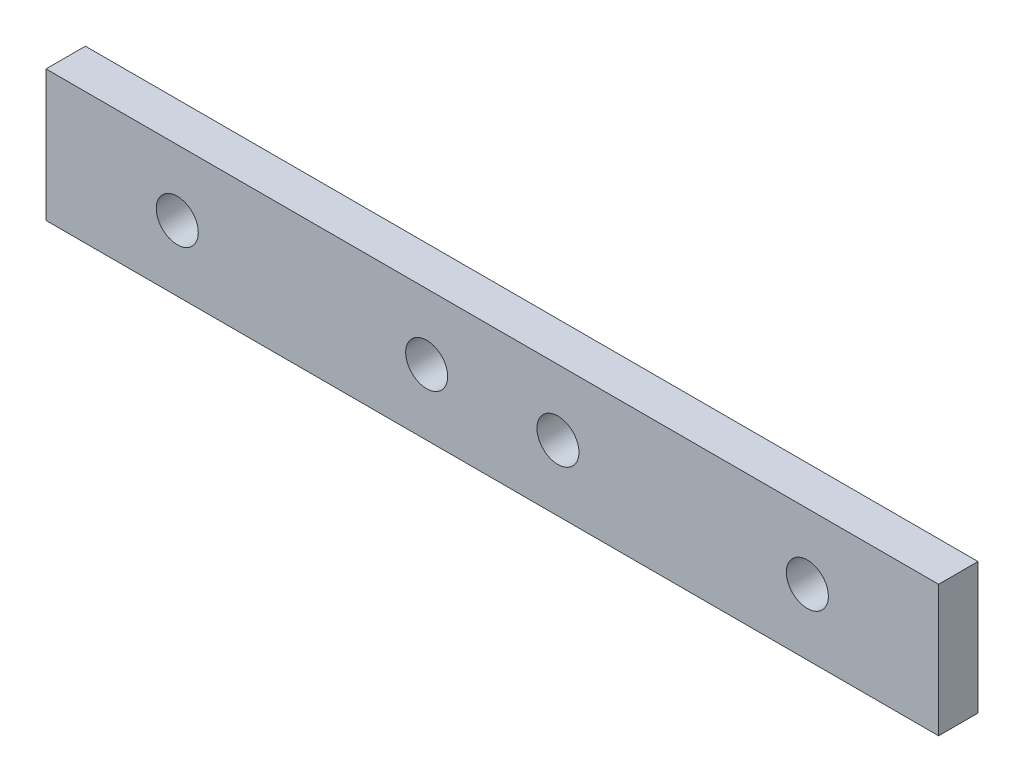
ISO-10303-21;
HEADER;
FILE_DESCRIPTION(('STEP AP214'),'2;1');
FILE_NAME('part.step','',(''),(''),'','','');
FILE_SCHEMA(('AUTOMOTIVE_DESIGN { 1 0 10303 214 1 1 1 1 }'));
ENDSEC;
DATA;
#1=APPLICATION_CONTEXT('core data for automotive mechanical design processes');
#2=APPLICATION_PROTOCOL_DEFINITION('international standard','automotive_design',2000,#1);
#3=PRODUCT_CONTEXT('',#1,'mechanical');
#4=PRODUCT('Part','Part','',(#3));
#5=PRODUCT_RELATED_PRODUCT_CATEGORY('part','',(#4));
#6=PRODUCT_DEFINITION_FORMATION('','',#4);
#7=PRODUCT_DEFINITION_CONTEXT('part definition',#1,'design');
#8=PRODUCT_DEFINITION('design','',#6,#7);
#9=PRODUCT_DEFINITION_SHAPE('','',#8);
#10=(LENGTH_UNIT() NAMED_UNIT(*) SI_UNIT(.MILLI.,.METRE.));
#11=(NAMED_UNIT(*) PLANE_ANGLE_UNIT() SI_UNIT($,.RADIAN.));
#12=(NAMED_UNIT(*) SI_UNIT($,.STERADIAN.) SOLID_ANGLE_UNIT());
#13=UNCERTAINTY_MEASURE_WITH_UNIT(LENGTH_MEASURE(1.E-05),#10,'distance_accuracy_value','');
#14=(GEOMETRIC_REPRESENTATION_CONTEXT(3) GLOBAL_UNCERTAINTY_ASSIGNED_CONTEXT((#13)) GLOBAL_UNIT_ASSIGNED_CONTEXT((#10,
#11,#12)) REPRESENTATION_CONTEXT('',''));
#15=CARTESIAN_POINT('',(0.,0.,0.));
#16=DIRECTION('',(0.,0.,1.));
#17=DIRECTION('',(1.,0.,0.));
#18=AXIS2_PLACEMENT_3D('',#15,#16,#17);
#19=CARTESIAN_POINT('',(0.,0.,3.));
#20=DIRECTION('',(0.,1.,0.));
#21=DIRECTION('',(0.,0.,1.));
#22=AXIS2_PLACEMENT_3D('',#19,#20,#21);
#23=PLANE('',#22);
#24=DIRECTION('',(1.,0.,0.));
#25=VECTOR('',#24,1.);
#26=CARTESIAN_POINT('',(0.,0.,0.));
#27=LINE('',#26,#25);
#28=CARTESIAN_POINT('',(0.,0.,0.));
#29=VERTEX_POINT('',#28);
#30=CARTESIAN_POINT('',(68.,0.,0.));
#31=VERTEX_POINT('',#30);
#32=EDGE_CURVE('E126',#29,#31,#27,.T.);
#33=ORIENTED_EDGE('',*,*,#32,.T.);
#34=DIRECTION('',(0.,0.,-1.));
#35=VECTOR('',#34,1.);
#36=CARTESIAN_POINT('',(68.,0.,3.));
#37=LINE('',#36,#35);
#38=CARTESIAN_POINT('',(68.,0.,3.));
#39=VERTEX_POINT('',#38);
#40=EDGE_CURVE('E11',#39,#31,#37,.T.);
#41=ORIENTED_EDGE('',*,*,#40,.F.);
#42=DIRECTION('',(1.,0.,0.));
#43=VECTOR('',#42,1.);
#44=CARTESIAN_POINT('',(0.,0.,3.));
#45=LINE('',#44,#43);
#46=CARTESIAN_POINT('',(0.,0.,3.));
#47=VERTEX_POINT('',#46);
#48=EDGE_CURVE('E92',#47,#39,#45,.T.);
#49=ORIENTED_EDGE('',*,*,#48,.F.);
#50=DIRECTION('',(0.,0.,-1.));
#51=VECTOR('',#50,1.);
#52=CARTESIAN_POINT('',(0.,0.,3.));
#53=LINE('',#52,#51);
#54=EDGE_CURVE('E59',#47,#29,#53,.T.);
#55=ORIENTED_EDGE('',*,*,#54,.T.);
#56=EDGE_LOOP('',(#33,#41,#49,#55));
#57=FACE_BOUND('',#56,.T.);
#58=ADVANCED_FACE('F41',(#57),#23,.F.);
#59=CARTESIAN_POINT('',(68.,0.,3.));
#60=DIRECTION('',(-1.,0.,0.));
#61=DIRECTION('',(0.,0.,1.));
#62=AXIS2_PLACEMENT_3D('',#59,#60,#61);
#63=PLANE('',#62);
#64=DIRECTION('',(0.,1.,0.));
#65=VECTOR('',#64,1.);
#66=CARTESIAN_POINT('',(68.,0.,0.));
#67=LINE('',#66,#65);
#68=CARTESIAN_POINT('',(68.,10.,0.));
#69=VERTEX_POINT('',#68);
#70=EDGE_CURVE('E98',#31,#69,#67,.T.);
#71=ORIENTED_EDGE('',*,*,#70,.T.);
#72=DIRECTION('',(0.,0.,-1.));
#73=VECTOR('',#72,1.);
#74=CARTESIAN_POINT('',(68.,10.,3.));
#75=LINE('',#74,#73);
#76=CARTESIAN_POINT('',(68.,10.,3.));
#77=VERTEX_POINT('',#76);
#78=EDGE_CURVE('E51',#77,#69,#75,.T.);
#79=ORIENTED_EDGE('',*,*,#78,.F.);
#80=DIRECTION('',(0.,1.,0.));
#81=VECTOR('',#80,1.);
#82=CARTESIAN_POINT('',(68.,0.,3.));
#83=LINE('',#82,#81);
#84=EDGE_CURVE('E84',#39,#77,#83,.T.);
#85=ORIENTED_EDGE('',*,*,#84,.F.);
#86=ORIENTED_EDGE('',*,*,#40,.T.);
#87=EDGE_LOOP('',(#71,#79,#85,#86));
#88=FACE_BOUND('',#87,.T.);
#89=ADVANCED_FACE('F97',(#88),#63,.F.);
#90=CARTESIAN_POINT('',(0.,10.,3.));
#91=DIRECTION('',(0.,1.,0.));
#92=DIRECTION('',(0.,0.,1.));
#93=AXIS2_PLACEMENT_3D('',#90,#91,#92);
#94=PLANE('',#93);
#95=DIRECTION('',(1.,0.,0.));
#96=VECTOR('',#95,1.);
#97=CARTESIAN_POINT('',(0.,10.,0.));
#98=LINE('',#97,#96);
#99=CARTESIAN_POINT('',(0.,10.,0.));
#100=VERTEX_POINT('',#99);
#101=EDGE_CURVE('E131',#100,#69,#98,.T.);
#102=ORIENTED_EDGE('',*,*,#101,.F.);
#103=DIRECTION('',(0.,0.,-1.));
#104=VECTOR('',#103,1.);
#105=CARTESIAN_POINT('',(0.,10.,3.));
#106=LINE('',#105,#104);
#107=CARTESIAN_POINT('',(0.,10.,3.));
#108=VERTEX_POINT('',#107);
#109=EDGE_CURVE('E73',#108,#100,#106,.T.);
#110=ORIENTED_EDGE('',*,*,#109,.F.);
#111=DIRECTION('',(1.,0.,0.));
#112=VECTOR('',#111,1.);
#113=CARTESIAN_POINT('',(0.,10.,3.));
#114=LINE('',#113,#112);
#115=EDGE_CURVE('E91',#108,#77,#114,.T.);
#116=ORIENTED_EDGE('',*,*,#115,.T.);
#117=ORIENTED_EDGE('',*,*,#78,.T.);
#118=EDGE_LOOP('',(#102,#110,#116,#117));
#119=FACE_BOUND('',#118,.T.);
#120=ADVANCED_FACE('F102',(#119),#94,.T.);
#121=CARTESIAN_POINT('',(10.,5.,3.));
#122=DIRECTION('',(0.,0.,-1.));
#123=DIRECTION('',(-1.,0.,0.));
#124=AXIS2_PLACEMENT_3D('',#121,#122,#123);
#125=CYLINDRICAL_SURFACE('',#124,1.6);
#126=CARTESIAN_POINT('',(10.,5.,3.));
#127=DIRECTION('',(0.,0.,1.));
#128=DIRECTION('',(1.,0.,0.));
#129=AXIS2_PLACEMENT_3D('',#126,#127,#128);
#130=CIRCLE('',#129,1.6);
#131=CARTESIAN_POINT('',(11.6,5.,3.));
#132=VERTEX_POINT('',#131);
#133=EDGE_CURVE('E157',#132,#132,#130,.T.);
#134=ORIENTED_EDGE('',*,*,#133,.T.);
#135=EDGE_LOOP('',(#134));
#136=FACE_BOUND('',#135,.T.);
#137=CARTESIAN_POINT('',(10.,5.,0.));
#138=DIRECTION('',(0.,0.,1.));
#139=DIRECTION('',(1.,0.,0.));
#140=AXIS2_PLACEMENT_3D('',#137,#138,#139);
#141=CIRCLE('',#140,1.6);
#142=CARTESIAN_POINT('',(11.6,5.,0.));
#143=VERTEX_POINT('',#142);
#144=EDGE_CURVE('E122',#143,#143,#141,.T.);
#145=ORIENTED_EDGE('',*,*,#144,.F.);
#146=EDGE_LOOP('',(#145));
#147=FACE_BOUND('',#146,.T.);
#148=ADVANCED_FACE('F163',(#136,#147),#125,.F.);
#149=CARTESIAN_POINT('',(29.,5.,3.));
#150=DIRECTION('',(0.,0.,-1.));
#151=DIRECTION('',(-1.,0.,0.));
#152=AXIS2_PLACEMENT_3D('',#149,#150,#151);
#153=CYLINDRICAL_SURFACE('',#152,1.6);
#154=CARTESIAN_POINT('',(29.,5.,3.));
#155=DIRECTION('',(0.,0.,1.));
#156=DIRECTION('',(1.,0.,0.));
#157=AXIS2_PLACEMENT_3D('',#154,#155,#156);
#158=CIRCLE('',#157,1.6);
#159=CARTESIAN_POINT('',(30.6,5.,3.));
#160=VERTEX_POINT('',#159);
#161=EDGE_CURVE('E151',#160,#160,#158,.T.);
#162=ORIENTED_EDGE('',*,*,#161,.T.);
#163=EDGE_LOOP('',(#162));
#164=FACE_BOUND('',#163,.T.);
#165=CARTESIAN_POINT('',(29.,5.,0.));
#166=DIRECTION('',(0.,0.,1.));
#167=DIRECTION('',(1.,0.,0.));
#168=AXIS2_PLACEMENT_3D('',#165,#166,#167);
#169=CIRCLE('',#168,1.6);
#170=CARTESIAN_POINT('',(30.6,5.,0.));
#171=VERTEX_POINT('',#170);
#172=EDGE_CURVE('E118',#171,#171,#169,.T.);
#173=ORIENTED_EDGE('',*,*,#172,.F.);
#174=EDGE_LOOP('',(#173));
#175=FACE_BOUND('',#174,.T.);
#176=ADVANCED_FACE('F189',(#164,#175),#153,.F.);
#177=CARTESIAN_POINT('',(39.,5.,3.));
#178=DIRECTION('',(0.,0.,-1.));
#179=DIRECTION('',(-1.,0.,0.));
#180=AXIS2_PLACEMENT_3D('',#177,#178,#179);
#181=CYLINDRICAL_SURFACE('',#180,1.6);
#182=CARTESIAN_POINT('',(39.,5.,3.));
#183=DIRECTION('',(0.,0.,1.));
#184=DIRECTION('',(1.,0.,0.));
#185=AXIS2_PLACEMENT_3D('',#182,#183,#184);
#186=CIRCLE('',#185,1.6);
#187=CARTESIAN_POINT('',(40.6,5.,3.));
#188=VERTEX_POINT('',#187);
#189=EDGE_CURVE('E145',#188,#188,#186,.T.);
#190=ORIENTED_EDGE('',*,*,#189,.T.);
#191=EDGE_LOOP('',(#190));
#192=FACE_BOUND('',#191,.T.);
#193=CARTESIAN_POINT('',(39.,5.,0.));
#194=DIRECTION('',(0.,0.,1.));
#195=DIRECTION('',(1.,0.,0.));
#196=AXIS2_PLACEMENT_3D('',#193,#194,#195);
#197=CIRCLE('',#196,1.6);
#198=CARTESIAN_POINT('',(40.6,5.,0.));
#199=VERTEX_POINT('',#198);
#200=EDGE_CURVE('E114',#199,#199,#197,.T.);
#201=ORIENTED_EDGE('',*,*,#200,.F.);
#202=EDGE_LOOP('',(#201));
#203=FACE_BOUND('',#202,.T.);
#204=ADVANCED_FACE('F191',(#192,#203),#181,.F.);
#205=CARTESIAN_POINT('',(58.,5.,3.));
#206=DIRECTION('',(0.,0.,-1.));
#207=DIRECTION('',(-1.,0.,0.));
#208=AXIS2_PLACEMENT_3D('',#205,#206,#207);
#209=CYLINDRICAL_SURFACE('',#208,1.6);
#210=CARTESIAN_POINT('',(58.,5.,3.));
#211=DIRECTION('',(0.,0.,1.));
#212=DIRECTION('',(1.,0.,0.));
#213=AXIS2_PLACEMENT_3D('',#210,#211,#212);
#214=CIRCLE('',#213,1.6);
#215=CARTESIAN_POINT('',(59.6,5.,3.));
#216=VERTEX_POINT('',#215);
#217=EDGE_CURVE('E138',#216,#216,#214,.T.);
#218=ORIENTED_EDGE('',*,*,#217,.T.);
#219=EDGE_LOOP('',(#218));
#220=FACE_BOUND('',#219,.T.);
#221=CARTESIAN_POINT('',(58.,5.,0.));
#222=DIRECTION('',(0.,0.,1.));
#223=DIRECTION('',(1.,0.,0.));
#224=AXIS2_PLACEMENT_3D('',#221,#222,#223);
#225=CIRCLE('',#224,1.6);
#226=CARTESIAN_POINT('',(59.6,5.,0.));
#227=VERTEX_POINT('',#226);
#228=EDGE_CURVE('E110',#227,#227,#225,.T.);
#229=ORIENTED_EDGE('',*,*,#228,.F.);
#230=EDGE_LOOP('',(#229));
#231=FACE_BOUND('',#230,.T.);
#232=ADVANCED_FACE('F43',(#220,#231),#209,.F.);
#233=CARTESIAN_POINT('',(0.,0.,3.));
#234=DIRECTION('',(-1.,0.,0.));
#235=DIRECTION('',(0.,0.,1.));
#236=AXIS2_PLACEMENT_3D('',#233,#234,#235);
#237=PLANE('',#236);
#238=DIRECTION('',(0.,1.,0.));
#239=VECTOR('',#238,1.);
#240=CARTESIAN_POINT('',(0.,0.,0.));
#241=LINE('',#240,#239);
#242=EDGE_CURVE('E134',#29,#100,#241,.T.);
#243=ORIENTED_EDGE('',*,*,#242,.F.);
#244=ORIENTED_EDGE('',*,*,#54,.F.);
#245=DIRECTION('',(0.,1.,0.));
#246=VECTOR('',#245,1.);
#247=CARTESIAN_POINT('',(0.,0.,3.));
#248=LINE('',#247,#246);
#249=EDGE_CURVE('E104',#47,#108,#248,.T.);
#250=ORIENTED_EDGE('',*,*,#249,.T.);
#251=ORIENTED_EDGE('',*,*,#109,.T.);
#252=EDGE_LOOP('',(#243,#244,#250,#251));
#253=FACE_BOUND('',#252,.T.);
#254=ADVANCED_FACE('F168',(#253),#237,.T.);
#255=CARTESIAN_POINT('',(0.,0.,3.));
#256=DIRECTION('',(0.,0.,1.));
#257=DIRECTION('',(1.,0.,0.));
#258=AXIS2_PLACEMENT_3D('',#255,#256,#257);
#259=PLANE('',#258);
#260=ORIENTED_EDGE('',*,*,#217,.F.);
#261=EDGE_LOOP('',(#260));
#262=FACE_BOUND('',#261,.T.);
#263=ORIENTED_EDGE('',*,*,#189,.F.);
#264=EDGE_LOOP('',(#263));
#265=FACE_BOUND('',#264,.T.);
#266=ORIENTED_EDGE('',*,*,#161,.F.);
#267=EDGE_LOOP('',(#266));
#268=FACE_BOUND('',#267,.T.);
#269=ORIENTED_EDGE('',*,*,#133,.F.);
#270=EDGE_LOOP('',(#269));
#271=FACE_BOUND('',#270,.T.);
#272=ORIENTED_EDGE('',*,*,#48,.T.);
#273=ORIENTED_EDGE('',*,*,#84,.T.);
#274=ORIENTED_EDGE('',*,*,#115,.F.);
#275=ORIENTED_EDGE('',*,*,#249,.F.);
#276=EDGE_LOOP('',(#272,#273,#274,#275));
#277=FACE_BOUND('',#276,.T.);
#278=ADVANCED_FACE('F88',(#262,#265,#268,#271,#277),#259,.T.);
#279=CARTESIAN_POINT('',(0.,0.,0.));
#280=DIRECTION('',(0.,0.,1.));
#281=DIRECTION('',(1.,0.,0.));
#282=AXIS2_PLACEMENT_3D('',#279,#280,#281);
#283=PLANE('',#282);
#284=ORIENTED_EDGE('',*,*,#228,.T.);
#285=EDGE_LOOP('',(#284));
#286=FACE_BOUND('',#285,.T.);
#287=ORIENTED_EDGE('',*,*,#200,.T.);
#288=EDGE_LOOP('',(#287));
#289=FACE_BOUND('',#288,.T.);
#290=ORIENTED_EDGE('',*,*,#172,.T.);
#291=EDGE_LOOP('',(#290));
#292=FACE_BOUND('',#291,.T.);
#293=ORIENTED_EDGE('',*,*,#144,.T.);
#294=EDGE_LOOP('',(#293));
#295=FACE_BOUND('',#294,.T.);
#296=ORIENTED_EDGE('',*,*,#32,.F.);
#297=ORIENTED_EDGE('',*,*,#242,.T.);
#298=ORIENTED_EDGE('',*,*,#101,.T.);
#299=ORIENTED_EDGE('',*,*,#70,.F.);
#300=EDGE_LOOP('',(#296,#297,#298,#299));
#301=FACE_BOUND('',#300,.T.);
#302=ADVANCED_FACE('F167',(#286,#289,#292,#295,#301),#283,.F.);
#303=CLOSED_SHELL('',(#58,#89,#120,#148,#176,#204,#232,#254,#278,#302));
#304=MANIFOLD_SOLID_BREP('B2',#303);
#305=ADVANCED_BREP_SHAPE_REPRESENTATION('',(#18,#304),#14);
#306=SHAPE_DEFINITION_REPRESENTATION(#9,#305);
ENDSEC;
END-ISO-10303-21;
